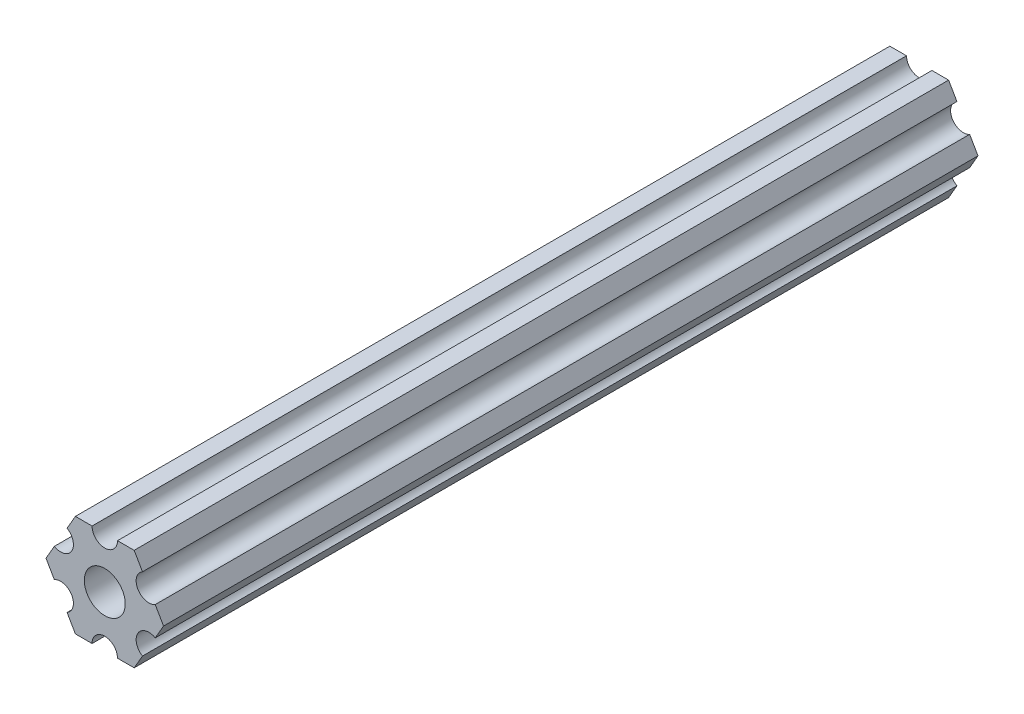
ISO-10303-21;
HEADER;
FILE_DESCRIPTION(('STEP AP214'),'2;1');
FILE_NAME('part.step','',(''),(''),'','','');
FILE_SCHEMA(('AUTOMOTIVE_DESIGN { 1 0 10303 214 1 1 1 1 }'));
ENDSEC;
DATA;
#1=APPLICATION_CONTEXT('core data for automotive mechanical design processes');
#2=APPLICATION_PROTOCOL_DEFINITION('international standard','automotive_design',2000,#1);
#3=PRODUCT_CONTEXT('',#1,'mechanical');
#4=PRODUCT('Part','Part','',(#3));
#5=PRODUCT_RELATED_PRODUCT_CATEGORY('part','',(#4));
#6=PRODUCT_DEFINITION_FORMATION('','',#4);
#7=PRODUCT_DEFINITION_CONTEXT('part definition',#1,'design');
#8=PRODUCT_DEFINITION('design','',#6,#7);
#9=PRODUCT_DEFINITION_SHAPE('','',#8);
#10=(LENGTH_UNIT() NAMED_UNIT(*) SI_UNIT(.MILLI.,.METRE.));
#11=(NAMED_UNIT(*) PLANE_ANGLE_UNIT() SI_UNIT($,.RADIAN.));
#12=(NAMED_UNIT(*) SI_UNIT($,.STERADIAN.) SOLID_ANGLE_UNIT());
#13=UNCERTAINTY_MEASURE_WITH_UNIT(LENGTH_MEASURE(1.E-05),#10,'distance_accuracy_value','');
#14=(GEOMETRIC_REPRESENTATION_CONTEXT(3) GLOBAL_UNCERTAINTY_ASSIGNED_CONTEXT((#13)) GLOBAL_UNIT_ASSIGNED_CONTEXT((#10,
#11,#12)) REPRESENTATION_CONTEXT('',''));
#15=CARTESIAN_POINT('',(0.,0.,0.));
#16=DIRECTION('',(0.,0.,1.));
#17=DIRECTION('',(1.,0.,0.));
#18=AXIS2_PLACEMENT_3D('',#15,#16,#17);
#19=CARTESIAN_POINT('',(3.84699344862377E-07,6.35000022210623,101.6));
#20=DIRECTION('',(0.,0.,-1.));
#21=DIRECTION('',(-1.,0.,0.));
#22=AXIS2_PLACEMENT_3D('',#19,#20,#21);
#23=CYLINDRICAL_SURFACE('',#22,1.58749807650328);
#24=CARTESIAN_POINT('',(3.84699344862377E-07,6.35000022210623,0.));
#25=DIRECTION('',(0.,0.,-1.));
#26=DIRECTION('',(-1.,0.,0.));
#27=AXIS2_PLACEMENT_3D('',#24,#25,#26);
#28=CIRCLE('',#27,1.58749807650328);
#29=CARTESIAN_POINT('',(1.58749807650328,6.35000022210623,0.));
#30=VERTEX_POINT('',#29);
#31=CARTESIAN_POINT('',(-1.58749807650328,6.35000022210623,0.));
#32=VERTEX_POINT('',#31);
#33=EDGE_CURVE('E216',#30,#32,#28,.T.);
#34=ORIENTED_EDGE('',*,*,#33,.T.);
#35=DIRECTION('',(0.,0.,-1.));
#36=VECTOR('',#35,1.);
#37=CARTESIAN_POINT('',(-1.58749807650328,6.35000022210623,101.6));
#38=LINE('',#37,#36);
#39=CARTESIAN_POINT('',(-1.58749807650328,6.35000022210623,101.6));
#40=VERTEX_POINT('',#39);
#41=EDGE_CURVE('E11',#40,#32,#38,.T.);
#42=ORIENTED_EDGE('',*,*,#41,.F.);
#43=CARTESIAN_POINT('',(3.84699344862377E-07,6.35000022210623,101.6));
#44=DIRECTION('',(0.,0.,-1.));
#45=DIRECTION('',(-1.,0.,0.));
#46=AXIS2_PLACEMENT_3D('',#43,#44,#45);
#47=CIRCLE('',#46,1.58749807650328);
#48=CARTESIAN_POINT('',(1.58749807650328,6.35000022210623,101.6));
#49=VERTEX_POINT('',#48);
#50=EDGE_CURVE('E251',#49,#40,#47,.T.);
#51=ORIENTED_EDGE('',*,*,#50,.F.);
#52=DIRECTION('',(0.,0.,-1.));
#53=VECTOR('',#52,1.);
#54=CARTESIAN_POINT('',(1.58749807650328,6.35000022210623,101.6));
#55=LINE('',#54,#53);
#56=EDGE_CURVE('E212',#49,#30,#55,.T.);
#57=ORIENTED_EDGE('',*,*,#56,.T.);
#58=EDGE_LOOP('',(#34,#42,#51,#57));
#59=FACE_BOUND('',#58,.T.);
#60=ADVANCED_FACE('F55',(#59),#23,.F.);
#61=CARTESIAN_POINT('',(-1.58749807650328,6.35000022210623,101.6));
#62=DIRECTION('',(0.,-1.,0.));
#63=DIRECTION('',(1.,0.,0.));
#64=AXIS2_PLACEMENT_3D('',#61,#62,#63);
#65=PLANE('',#64);
#66=DIRECTION('',(-1.,0.,0.));
#67=VECTOR('',#66,1.);
#68=CARTESIAN_POINT('',(-1.58749807650328,6.35000022210623,0.));
#69=LINE('',#68,#67);
#70=CARTESIAN_POINT('',(-3.66617382465472,6.35000022210623,0.));
#71=VERTEX_POINT('',#70);
#72=EDGE_CURVE('E219',#32,#71,#69,.T.);
#73=ORIENTED_EDGE('',*,*,#72,.T.);
#74=DIRECTION('',(0.,0.,-1.));
#75=VECTOR('',#74,1.);
#76=CARTESIAN_POINT('',(-3.66617382465472,6.35000022210623,101.6));
#77=LINE('',#76,#75);
#78=CARTESIAN_POINT('',(-3.66617382465472,6.35000022210623,101.6));
#79=VERTEX_POINT('',#78);
#80=EDGE_CURVE('E64',#79,#71,#77,.T.);
#81=ORIENTED_EDGE('',*,*,#80,.F.);
#82=DIRECTION('',(-1.,0.,0.));
#83=VECTOR('',#82,1.);
#84=CARTESIAN_POINT('',(-1.58749807650328,6.35000022210623,101.6));
#85=LINE('',#84,#83);
#86=EDGE_CURVE('E145',#40,#79,#85,.T.);
#87=ORIENTED_EDGE('',*,*,#86,.F.);
#88=ORIENTED_EDGE('',*,*,#41,.T.);
#89=EDGE_LOOP('',(#73,#81,#87,#88));
#90=FACE_BOUND('',#89,.T.);
#91=ADVANCED_FACE('F371',(#90),#65,.F.);
#92=CARTESIAN_POINT('',(-3.66617382465472,6.35000022210623,101.6));
#93=DIRECTION('',(0.866025373493145,-0.500000052466056,0.));
#94=DIRECTION('',(0.500000052466056,0.866025373493145,0.));
#95=AXIS2_PLACEMENT_3D('',#92,#93,#94);
#96=PLANE('',#95);
#97=DIRECTION('',(-0.500000052466056,-0.866025373493145,0.));
#98=VECTOR('',#97,1.);
#99=CARTESIAN_POINT('',(-3.66617382465472,6.35000022210623,0.));
#100=LINE('',#99,#98);
#101=CARTESIAN_POINT('',(-4.70551103839166,4.54981561357968,0.));
#102=VERTEX_POINT('',#101);
#103=EDGE_CURVE('E222',#71,#102,#100,.T.);
#104=ORIENTED_EDGE('',*,*,#103,.T.);
#105=DIRECTION('',(0.,0.,-1.));
#106=VECTOR('',#105,1.);
#107=CARTESIAN_POINT('',(-4.70551103839166,4.54981561357968,101.6));
#108=LINE('',#107,#106);
#109=CARTESIAN_POINT('',(-4.70551103839166,4.54981561357968,101.6));
#110=VERTEX_POINT('',#109);
#111=EDGE_CURVE('E298',#110,#102,#108,.T.);
#112=ORIENTED_EDGE('',*,*,#111,.F.);
#113=DIRECTION('',(-0.500000052466056,-0.866025373493145,0.));
#114=VECTOR('',#113,1.);
#115=CARTESIAN_POINT('',(-3.66617382465472,6.35000022210623,101.6));
#116=LINE('',#115,#114);
#117=EDGE_CURVE('E306',#79,#110,#116,.T.);
#118=ORIENTED_EDGE('',*,*,#117,.F.);
#119=ORIENTED_EDGE('',*,*,#80,.T.);
#120=EDGE_LOOP('',(#104,#112,#118,#119));
#121=FACE_BOUND('',#120,.T.);
#122=ADVANCED_FACE('F304',(#121),#96,.F.);
#123=CARTESIAN_POINT('',(-5.49926112168152,3.17500033315931,101.6));
#124=DIRECTION('',(0.,0.,-1.));
#125=DIRECTION('',(-1.,0.,0.));
#126=AXIS2_PLACEMENT_3D('',#123,#124,#125);
#127=CYLINDRICAL_SURFACE('',#126,1.5875);
#128=CARTESIAN_POINT('',(-5.49926112168152,3.17500033315931,0.));
#129=DIRECTION('',(0.,0.,-1.));
#130=DIRECTION('',(-1.,0.,0.));
#131=AXIS2_PLACEMENT_3D('',#128,#129,#130);
#132=CIRCLE('',#131,1.5875);
#133=CARTESIAN_POINT('',(-6.29301120497139,1.80018505273894,0.));
#134=VERTEX_POINT('',#133);
#135=EDGE_CURVE('E224',#102,#134,#132,.T.);
#136=ORIENTED_EDGE('',*,*,#135,.T.);
#137=DIRECTION('',(0.,0.,-1.));
#138=VECTOR('',#137,1.);
#139=CARTESIAN_POINT('',(-6.29301120497139,1.80018505273894,101.6));
#140=LINE('',#139,#138);
#141=CARTESIAN_POINT('',(-6.29301120497139,1.80018505273894,101.6));
#142=VERTEX_POINT('',#141);
#143=EDGE_CURVE('E295',#142,#134,#140,.T.);
#144=ORIENTED_EDGE('',*,*,#143,.F.);
#145=CARTESIAN_POINT('',(-5.49926112168152,3.17500033315931,101.6));
#146=DIRECTION('',(0.,0.,-1.));
#147=DIRECTION('',(-1.,0.,0.));
#148=AXIS2_PLACEMENT_3D('',#145,#146,#147);
#149=CIRCLE('',#148,1.5875);
#150=EDGE_CURVE('E324',#110,#142,#149,.T.);
#151=ORIENTED_EDGE('',*,*,#150,.F.);
#152=ORIENTED_EDGE('',*,*,#111,.T.);
#153=EDGE_LOOP('',(#136,#144,#151,#152));
#154=FACE_BOUND('',#153,.T.);
#155=ADVANCED_FACE('F315',(#154),#127,.F.);
#156=CARTESIAN_POINT('',(-6.29301120497139,1.80018505273894,101.6));
#157=DIRECTION('',(0.866025373493145,-0.500000052466056,0.));
#158=DIRECTION('',(0.500000052466056,0.866025373493145,0.));
#159=AXIS2_PLACEMENT_3D('',#156,#157,#158);
#160=PLANE('',#159);
#161=DIRECTION('',(-0.500000052466056,-0.866025373493145,0.));
#162=VECTOR('',#161,1.);
#163=CARTESIAN_POINT('',(-6.29301120497139,1.80018505273894,0.));
#164=LINE('',#163,#162);
#165=CARTESIAN_POINT('',(-7.33234841870826,4.44212515946299E-07,0.));
#166=VERTEX_POINT('',#165);
#167=EDGE_CURVE('E226',#134,#166,#164,.T.);
#168=ORIENTED_EDGE('',*,*,#167,.T.);
#169=DIRECTION('',(0.,0.,-1.));
#170=VECTOR('',#169,1.);
#171=CARTESIAN_POINT('',(-7.33234841870826,4.44212515946299E-07,101.6));
#172=LINE('',#171,#170);
#173=CARTESIAN_POINT('',(-7.33234841870826,4.44212515946299E-07,101.6));
#174=VERTEX_POINT('',#173);
#175=EDGE_CURVE('E292',#174,#166,#172,.T.);
#176=ORIENTED_EDGE('',*,*,#175,.F.);
#177=DIRECTION('',(-0.500000052466056,-0.866025373493145,0.));
#178=VECTOR('',#177,1.);
#179=CARTESIAN_POINT('',(-6.29301120497139,1.80018505273894,101.6));
#180=LINE('',#179,#178);
#181=EDGE_CURVE('E321',#142,#174,#180,.T.);
#182=ORIENTED_EDGE('',*,*,#181,.F.);
#183=ORIENTED_EDGE('',*,*,#143,.T.);
#184=EDGE_LOOP('',(#168,#176,#182,#183));
#185=FACE_BOUND('',#184,.T.);
#186=ADVANCED_FACE('F319',(#185),#160,.F.);
#187=CARTESIAN_POINT('',(-7.33234841870826,4.44212515946299E-07,101.6));
#188=DIRECTION('',(0.866025434075723,0.499999947533953,0.));
#189=DIRECTION('',(-0.499999947533953,0.866025434075723,0.));
#190=AXIS2_PLACEMENT_3D('',#187,#188,#189);
#191=PLANE('',#190);
#192=DIRECTION('',(0.499999947533953,-0.866025434075723,0.));
#193=VECTOR('',#192,1.);
#194=CARTESIAN_POINT('',(-7.33234841870826,4.44212515946299E-07,0.));
#195=LINE('',#194,#193);
#196=CARTESIAN_POINT('',(-6.29301142309098,-1.80018429024546,0.));
#197=VERTEX_POINT('',#196);
#198=EDGE_CURVE('E228',#166,#197,#195,.T.);
#199=ORIENTED_EDGE('',*,*,#198,.T.);
#200=DIRECTION('',(0.,0.,-1.));
#201=VECTOR('',#200,1.);
#202=CARTESIAN_POINT('',(-6.29301142309098,-1.80018429024546,101.6));
#203=LINE('',#202,#201);
#204=CARTESIAN_POINT('',(-6.29301142309098,-1.80018429024546,101.6));
#205=VERTEX_POINT('',#204);
#206=EDGE_CURVE('E288',#205,#197,#203,.T.);
#207=ORIENTED_EDGE('',*,*,#206,.F.);
#208=DIRECTION('',(0.499999947533953,-0.866025434075723,0.));
#209=VECTOR('',#208,1.);
#210=CARTESIAN_POINT('',(-7.33234841870826,4.44212515946299E-07,101.6));
#211=LINE('',#210,#209);
#212=EDGE_CURVE('E323',#174,#205,#211,.T.);
#213=ORIENTED_EDGE('',*,*,#212,.F.);
#214=ORIENTED_EDGE('',*,*,#175,.T.);
#215=EDGE_LOOP('',(#199,#207,#213,#214));
#216=FACE_BOUND('',#215,.T.);
#217=ADVANCED_FACE('F384',(#216),#191,.F.);
#218=CARTESIAN_POINT('',(-5.49926150638083,-3.17499966684068,101.6));
#219=DIRECTION('',(0.,0.,-1.));
#220=DIRECTION('',(-1.,0.,0.));
#221=AXIS2_PLACEMENT_3D('',#218,#219,#220);
#222=CYLINDRICAL_SURFACE('',#221,1.58750000000001);
#223=CARTESIAN_POINT('',(-5.49926150638083,-3.17499966684068,0.));
#224=DIRECTION('',(0.,0.,-1.));
#225=DIRECTION('',(-1.,0.,0.));
#226=AXIS2_PLACEMENT_3D('',#223,#224,#225);
#227=CIRCLE('',#226,1.58750000000001);
#228=CARTESIAN_POINT('',(-4.70551158967068,-4.54981504343589,0.));
#229=VERTEX_POINT('',#228);
#230=EDGE_CURVE('E230',#197,#229,#227,.T.);
#231=ORIENTED_EDGE('',*,*,#230,.T.);
#232=DIRECTION('',(0.,0.,-1.));
#233=VECTOR('',#232,1.);
#234=CARTESIAN_POINT('',(-4.70551158967068,-4.54981504343589,101.6));
#235=LINE('',#234,#233);
#236=CARTESIAN_POINT('',(-4.70551158967068,-4.54981504343589,101.6));
#237=VERTEX_POINT('',#236);
#238=EDGE_CURVE('E284',#237,#229,#235,.T.);
#239=ORIENTED_EDGE('',*,*,#238,.F.);
#240=CARTESIAN_POINT('',(-5.49926150638083,-3.17499966684068,101.6));
#241=DIRECTION('',(0.,0.,-1.));
#242=DIRECTION('',(-1.,0.,0.));
#243=AXIS2_PLACEMENT_3D('',#240,#241,#242);
#244=CIRCLE('',#243,1.58750000000001);
#245=EDGE_CURVE('E326',#205,#237,#244,.T.);
#246=ORIENTED_EDGE('',*,*,#245,.F.);
#247=ORIENTED_EDGE('',*,*,#206,.T.);
#248=EDGE_LOOP('',(#231,#239,#246,#247));
#249=FACE_BOUND('',#248,.T.);
#250=ADVANCED_FACE('F387',(#249),#222,.F.);
#251=CARTESIAN_POINT('',(-4.70551158967068,-4.54981504343589,101.6));
#252=DIRECTION('',(0.866025434075723,0.499999947533953,0.));
#253=DIRECTION('',(-0.499999947533953,0.866025434075723,0.));
#254=AXIS2_PLACEMENT_3D('',#251,#252,#253);
#255=PLANE('',#254);
#256=DIRECTION('',(0.499999947533953,-0.866025434075723,0.));
#257=VECTOR('',#256,1.);
#258=CARTESIAN_POINT('',(-4.70551158967068,-4.54981504343589,0.));
#259=LINE('',#258,#257);
#260=CARTESIAN_POINT('',(-3.66617452134693,-6.34999990382519,0.));
#261=VERTEX_POINT('',#260);
#262=EDGE_CURVE('E232',#229,#261,#259,.T.);
#263=ORIENTED_EDGE('',*,*,#262,.T.);
#264=DIRECTION('',(0.,0.,-1.));
#265=VECTOR('',#264,1.);
#266=CARTESIAN_POINT('',(-3.66617452134693,-6.34999990382519,101.6));
#267=LINE('',#266,#265);
#268=CARTESIAN_POINT('',(-3.66617452134693,-6.34999990382519,101.6));
#269=VERTEX_POINT('',#268);
#270=EDGE_CURVE('E280',#269,#261,#267,.T.);
#271=ORIENTED_EDGE('',*,*,#270,.F.);
#272=DIRECTION('',(0.499999947533953,-0.866025434075723,0.));
#273=VECTOR('',#272,1.);
#274=CARTESIAN_POINT('',(-4.70551158967068,-4.54981504343589,101.6));
#275=LINE('',#274,#273);
#276=EDGE_CURVE('E332',#237,#269,#275,.T.);
#277=ORIENTED_EDGE('',*,*,#276,.F.);
#278=ORIENTED_EDGE('',*,*,#238,.T.);
#279=EDGE_LOOP('',(#263,#271,#277,#278));
#280=FACE_BOUND('',#279,.T.);
#281=ADVANCED_FACE('F390',(#280),#255,.F.);
#282=CARTESIAN_POINT('',(-3.66617452134693,-6.34999990382519,101.6));
#283=DIRECTION('',(0.,1.,0.));
#284=DIRECTION('',(0.,0.,1.));
#285=AXIS2_PLACEMENT_3D('',#282,#283,#284);
#286=PLANE('',#285);
#287=DIRECTION('',(1.,0.,0.));
#288=VECTOR('',#287,1.);
#289=CARTESIAN_POINT('',(-3.66617452134693,-6.34999990382519,0.));
#290=LINE('',#289,#288);
#291=CARTESIAN_POINT('',(-1.58750192349631,-6.34999990382519,0.));
#292=VERTEX_POINT('',#291);
#293=EDGE_CURVE('E234',#261,#292,#290,.T.);
#294=ORIENTED_EDGE('',*,*,#293,.T.);
#295=DIRECTION('',(0.,0.,-1.));
#296=VECTOR('',#295,1.);
#297=CARTESIAN_POINT('',(-1.58750192349631,-6.34999990382519,101.6));
#298=LINE('',#297,#296);
#299=CARTESIAN_POINT('',(-1.58750192349631,-6.34999990382519,101.6));
#300=VERTEX_POINT('',#299);
#301=EDGE_CURVE('E277',#300,#292,#298,.T.);
#302=ORIENTED_EDGE('',*,*,#301,.F.);
#303=DIRECTION('',(1.,0.,0.));
#304=VECTOR('',#303,1.);
#305=CARTESIAN_POINT('',(-3.66617452134693,-6.34999990382519,101.6));
#306=LINE('',#305,#304);
#307=EDGE_CURVE('E334',#269,#300,#306,.T.);
#308=ORIENTED_EDGE('',*,*,#307,.F.);
#309=ORIENTED_EDGE('',*,*,#270,.T.);
#310=EDGE_LOOP('',(#294,#302,#308,#309));
#311=FACE_BOUND('',#310,.T.);
#312=ADVANCED_FACE('F394',(#311),#286,.F.);
#313=CARTESIAN_POINT('',(-3.84699262029331E-07,-6.34999990382519,101.6));
#314=DIRECTION('',(0.,0.,-1.));
#315=DIRECTION('',(-1.,0.,0.));
#316=AXIS2_PLACEMENT_3D('',#313,#314,#315);
#317=CYLINDRICAL_SURFACE('',#316,1.58750192349631);
#318=CARTESIAN_POINT('',(-3.84699262029331E-07,-6.34999990382519,0.));
#319=DIRECTION('',(0.,0.,-1.));
#320=DIRECTION('',(-1.,0.,0.));
#321=AXIS2_PLACEMENT_3D('',#318,#319,#320);
#322=CIRCLE('',#321,1.58750192349631);
#323=CARTESIAN_POINT('',(1.58750153879705,-6.34999990382519,0.));
#324=VERTEX_POINT('',#323);
#325=EDGE_CURVE('E236',#292,#324,#322,.T.);
#326=ORIENTED_EDGE('',*,*,#325,.T.);
#327=DIRECTION('',(0.,0.,-1.));
#328=VECTOR('',#327,1.);
#329=CARTESIAN_POINT('',(1.58750153879705,-6.34999990382519,101.6));
#330=LINE('',#329,#328);
#331=CARTESIAN_POINT('',(1.58750153879705,-6.34999990382519,101.6));
#332=VERTEX_POINT('',#331);
#333=EDGE_CURVE('E273',#332,#324,#330,.T.);
#334=ORIENTED_EDGE('',*,*,#333,.F.);
#335=CARTESIAN_POINT('',(-3.84699262029331E-07,-6.34999990382519,101.6));
#336=DIRECTION('',(0.,0.,-1.));
#337=DIRECTION('',(-1.,0.,0.));
#338=AXIS2_PLACEMENT_3D('',#335,#336,#337);
#339=CIRCLE('',#338,1.58750192349631);
#340=EDGE_CURVE('E336',#300,#332,#339,.T.);
#341=ORIENTED_EDGE('',*,*,#340,.F.);
#342=ORIENTED_EDGE('',*,*,#301,.T.);
#343=EDGE_LOOP('',(#326,#334,#341,#342));
#344=FACE_BOUND('',#343,.T.);
#345=ADVANCED_FACE('F397',(#344),#317,.F.);
#346=CARTESIAN_POINT('',(1.58750192349631,-6.34999990382519,101.6));
#347=DIRECTION('',(0.,1.,0.));
#348=DIRECTION('',(0.,0.,1.));
#349=AXIS2_PLACEMENT_3D('',#346,#347,#348);
#350=PLANE('',#349);
#351=DIRECTION('',(1.,0.,0.));
#352=VECTOR('',#351,1.);
#353=CARTESIAN_POINT('',(1.58750192349631,-6.34999990382519,0.));
#354=LINE('',#353,#352);
#355=CARTESIAN_POINT('',(3.66617382465481,-6.34999990382519,0.));
#356=VERTEX_POINT('',#355);
#357=EDGE_CURVE('E238',#324,#356,#354,.T.);
#358=ORIENTED_EDGE('',*,*,#357,.T.);
#359=DIRECTION('',(0.,0.,-1.));
#360=VECTOR('',#359,1.);
#361=CARTESIAN_POINT('',(3.66617382465481,-6.34999990382519,101.6));
#362=LINE('',#361,#360);
#363=CARTESIAN_POINT('',(3.66617382465481,-6.34999990382519,101.6));
#364=VERTEX_POINT('',#363);
#365=EDGE_CURVE('E269',#364,#356,#362,.T.);
#366=ORIENTED_EDGE('',*,*,#365,.F.);
#367=DIRECTION('',(1.,0.,0.));
#368=VECTOR('',#367,1.);
#369=CARTESIAN_POINT('',(1.58750192349631,-6.34999990382519,101.6));
#370=LINE('',#369,#368);
#371=EDGE_CURVE('E338',#332,#364,#370,.T.);
#372=ORIENTED_EDGE('',*,*,#371,.F.);
#373=ORIENTED_EDGE('',*,*,#333,.T.);
#374=EDGE_LOOP('',(#358,#366,#372,#373));
#375=FACE_BOUND('',#374,.T.);
#376=ADVANCED_FACE('F401',(#375),#350,.F.);
#377=CARTESIAN_POINT('',(3.66617382465481,-6.34999990382519,101.6));
#378=DIRECTION('',(-0.866025403784439,0.5,0.));
#379=DIRECTION('',(-0.5,-0.866025403784439,0.));
#380=AXIS2_PLACEMENT_3D('',#377,#378,#379);
#381=PLANE('',#380);
#382=DIRECTION('',(0.5,0.866025403784439,0.));
#383=VECTOR('',#382,1.);
#384=CARTESIAN_POINT('',(3.66617382465481,-6.34999990382519,0.));
#385=LINE('',#384,#383);
#386=CARTESIAN_POINT('',(4.70551092933191,-4.54981523233291,0.));
#387=VERTEX_POINT('',#386);
#388=EDGE_CURVE('E240',#356,#387,#385,.T.);
#389=ORIENTED_EDGE('',*,*,#388,.T.);
#390=DIRECTION('',(0.,0.,-1.));
#391=VECTOR('',#390,1.);
#392=CARTESIAN_POINT('',(4.70551092933191,-4.54981523233291,101.6));
#393=LINE('',#392,#391);
#394=CARTESIAN_POINT('',(4.70551092933191,-4.54981523233291,101.6));
#395=VERTEX_POINT('',#394);
#396=EDGE_CURVE('E265',#395,#387,#393,.T.);
#397=ORIENTED_EDGE('',*,*,#396,.F.);
#398=DIRECTION('',(0.5,0.866025403784439,0.));
#399=VECTOR('',#398,1.);
#400=CARTESIAN_POINT('',(3.66617382465481,-6.34999990382519,101.6));
#401=LINE('',#400,#399);
#402=EDGE_CURVE('E340',#364,#395,#401,.T.);
#403=ORIENTED_EDGE('',*,*,#402,.F.);
#404=ORIENTED_EDGE('',*,*,#365,.T.);
#405=EDGE_LOOP('',(#389,#397,#403,#404));
#406=FACE_BOUND('',#405,.T.);
#407=ADVANCED_FACE('F405',(#406),#381,.F.);
#408=CARTESIAN_POINT('',(5.49926092933191,-3.17499990382512,101.6));
#409=DIRECTION('',(0.,0.,-1.));
#410=DIRECTION('',(-1.,0.,0.));
#411=AXIS2_PLACEMENT_3D('',#408,#409,#410);
#412=CYLINDRICAL_SURFACE('',#411,1.5875);
#413=CARTESIAN_POINT('',(5.49926092933191,-3.17499990382512,0.));
#414=DIRECTION('',(0.,0.,-1.));
#415=DIRECTION('',(-1.,0.,0.));
#416=AXIS2_PLACEMENT_3D('',#413,#414,#415);
#417=CIRCLE('',#416,1.5875);
#418=CARTESIAN_POINT('',(6.29301092933191,-1.80018457531732,0.));
#419=VERTEX_POINT('',#418);
#420=EDGE_CURVE('E242',#387,#419,#417,.T.);
#421=ORIENTED_EDGE('',*,*,#420,.T.);
#422=DIRECTION('',(0.,0.,-1.));
#423=VECTOR('',#422,1.);
#424=CARTESIAN_POINT('',(6.29301092933191,-1.80018457531732,101.6));
#425=LINE('',#424,#423);
#426=CARTESIAN_POINT('',(6.29301092933191,-1.80018457531732,101.6));
#427=VERTEX_POINT('',#426);
#428=EDGE_CURVE('E261',#427,#419,#425,.T.);
#429=ORIENTED_EDGE('',*,*,#428,.F.);
#430=CARTESIAN_POINT('',(5.49926092933191,-3.17499990382512,101.6));
#431=DIRECTION('',(0.,0.,-1.));
#432=DIRECTION('',(-1.,0.,0.));
#433=AXIS2_PLACEMENT_3D('',#430,#431,#432);
#434=CIRCLE('',#433,1.5875);
#435=EDGE_CURVE('E342',#395,#427,#434,.T.);
#436=ORIENTED_EDGE('',*,*,#435,.F.);
#437=ORIENTED_EDGE('',*,*,#396,.T.);
#438=EDGE_LOOP('',(#421,#429,#436,#437));
#439=FACE_BOUND('',#438,.T.);
#440=ADVANCED_FACE('F408',(#439),#412,.F.);
#441=CARTESIAN_POINT('',(6.29301092933191,-1.80018457531732,101.6));
#442=DIRECTION('',(-0.866025403784439,0.5,0.));
#443=DIRECTION('',(-0.5,-0.866025403784439,0.));
#444=AXIS2_PLACEMENT_3D('',#441,#442,#443);
#445=PLANE('',#444);
#446=DIRECTION('',(0.5,0.866025403784439,0.));
#447=VECTOR('',#446,1.);
#448=CARTESIAN_POINT('',(6.29301092933191,-1.80018457531732,0.));
#449=LINE('',#448,#447);
#450=CARTESIAN_POINT('',(7.33234803400894,9.6174836107174E-08,0.));
#451=VERTEX_POINT('',#450);
#452=EDGE_CURVE('E244',#419,#451,#449,.T.);
#453=ORIENTED_EDGE('',*,*,#452,.T.);
#454=DIRECTION('',(0.,0.,-1.));
#455=VECTOR('',#454,1.);
#456=CARTESIAN_POINT('',(7.33234803400894,9.6174836107174E-08,101.6));
#457=LINE('',#456,#455);
#458=CARTESIAN_POINT('',(7.33234803400894,9.6174836107174E-08,101.6));
#459=VERTEX_POINT('',#458);
#460=EDGE_CURVE('E257',#459,#451,#457,.T.);
#461=ORIENTED_EDGE('',*,*,#460,.F.);
#462=DIRECTION('',(0.5,0.866025403784439,0.));
#463=VECTOR('',#462,1.);
#464=CARTESIAN_POINT('',(6.29301092933191,-1.80018457531732,101.6));
#465=LINE('',#464,#463);
#466=EDGE_CURVE('E344',#427,#459,#465,.T.);
#467=ORIENTED_EDGE('',*,*,#466,.F.);
#468=ORIENTED_EDGE('',*,*,#428,.T.);
#469=EDGE_LOOP('',(#453,#461,#467,#468));
#470=FACE_BOUND('',#469,.T.);
#471=ADVANCED_FACE('F350',(#470),#445,.F.);
#472=CARTESIAN_POINT('',(7.33234803400894,9.6174836107174E-08,101.6));
#473=DIRECTION('',(-0.866025449221368,-0.499999921300921,0.));
#474=DIRECTION('',(0.499999921300921,-0.866025449221368,0.));
#475=AXIS2_PLACEMENT_3D('',#472,#473,#474);
#476=PLANE('',#475);
#477=DIRECTION('',(-0.499999921300921,0.866025449221368,0.));
#478=VECTOR('',#477,1.);
#479=CARTESIAN_POINT('',(7.33234803400894,9.6174836107174E-08,0.));
#480=LINE('',#479,#478);
#481=CARTESIAN_POINT('',(6.29301117773375,1.80018471521667,0.));
#482=VERTEX_POINT('',#481);
#483=EDGE_CURVE('E246',#451,#482,#480,.T.);
#484=ORIENTED_EDGE('',*,*,#483,.T.);
#485=DIRECTION('',(0.,0.,-1.));
#486=VECTOR('',#485,1.);
#487=CARTESIAN_POINT('',(6.29301117773375,1.80018471521667,101.6));
#488=LINE('',#487,#486);
#489=CARTESIAN_POINT('',(6.29301117773375,1.80018471521667,101.6));
#490=VERTEX_POINT('',#489);
#491=EDGE_CURVE('E204',#490,#482,#488,.T.);
#492=ORIENTED_EDGE('',*,*,#491,.F.);
#493=DIRECTION('',(-0.499999921300921,0.866025449221368,0.));
#494=VECTOR('',#493,1.);
#495=CARTESIAN_POINT('',(7.33234803400894,9.6174836107174E-08,101.6));
#496=LINE('',#495,#494);
#497=EDGE_CURVE('E194',#459,#490,#496,.T.);
#498=ORIENTED_EDGE('',*,*,#497,.F.);
#499=ORIENTED_EDGE('',*,*,#460,.T.);
#500=EDGE_LOOP('',(#484,#492,#498,#499));
#501=FACE_BOUND('',#500,.T.);
#502=ADVANCED_FACE('F354',(#501),#476,.F.);
#503=CARTESIAN_POINT('',(5.49926130266854,3.1750001158556,101.6));
#504=DIRECTION('',(0.,0.,-1.));
#505=DIRECTION('',(-1.,0.,0.));
#506=AXIS2_PLACEMENT_3D('',#503,#504,#505);
#507=CYLINDRICAL_SURFACE('',#506,1.5875);
#508=CARTESIAN_POINT('',(5.49926130266854,3.1750001158556,0.));
#509=DIRECTION('',(0.,0.,-1.));
#510=DIRECTION('',(-1.,0.,0.));
#511=AXIS2_PLACEMENT_3D('',#508,#509,#510);
#512=CIRCLE('',#511,1.5875);
#513=CARTESIAN_POINT('',(4.70551142760333,4.54981551649452,0.));
#514=VERTEX_POINT('',#513);
#515=EDGE_CURVE('E202',#482,#514,#512,.T.);
#516=ORIENTED_EDGE('',*,*,#515,.T.);
#517=DIRECTION('',(0.,0.,-1.));
#518=VECTOR('',#517,1.);
#519=CARTESIAN_POINT('',(4.70551142760333,4.54981551649452,101.6));
#520=LINE('',#519,#518);
#521=CARTESIAN_POINT('',(4.70551142760333,4.54981551649452,101.6));
#522=VERTEX_POINT('',#521);
#523=EDGE_CURVE('E199',#522,#514,#520,.T.);
#524=ORIENTED_EDGE('',*,*,#523,.F.);
#525=CARTESIAN_POINT('',(5.49926130266854,3.1750001158556,101.6));
#526=DIRECTION('',(0.,0.,-1.));
#527=DIRECTION('',(-1.,0.,0.));
#528=AXIS2_PLACEMENT_3D('',#525,#526,#527);
#529=CIRCLE('',#528,1.5875);
#530=EDGE_CURVE('E188',#490,#522,#529,.T.);
#531=ORIENTED_EDGE('',*,*,#530,.F.);
#532=ORIENTED_EDGE('',*,*,#491,.T.);
#533=EDGE_LOOP('',(#516,#524,#531,#532));
#534=FACE_BOUND('',#533,.T.);
#535=ADVANCED_FACE('F200',(#534),#507,.F.);
#536=CARTESIAN_POINT('',(4.70551142760333,4.54981551649452,101.6));
#537=DIRECTION('',(-0.866025449221368,-0.499999921300922,0.));
#538=DIRECTION('',(0.499999921300922,-0.866025449221368,0.));
#539=AXIS2_PLACEMENT_3D('',#536,#537,#538);
#540=PLANE('',#539);
#541=DIRECTION('',(-0.499999921300921,0.866025449221368,0.));
#542=VECTOR('',#541,1.);
#543=CARTESIAN_POINT('',(4.70551142760333,4.54981551649452,0.));
#544=LINE('',#543,#542);
#545=CARTESIAN_POINT('',(3.66617452134701,6.35000022210623,0.));
#546=VERTEX_POINT('',#545);
#547=EDGE_CURVE('E131',#514,#546,#544,.T.);
#548=ORIENTED_EDGE('',*,*,#547,.T.);
#549=DIRECTION('',(0.,0.,-1.));
#550=VECTOR('',#549,1.);
#551=CARTESIAN_POINT('',(3.66617452134701,6.35000022210623,101.6));
#552=LINE('',#551,#550);
#553=CARTESIAN_POINT('',(3.66617452134701,6.35000022210623,101.6));
#554=VERTEX_POINT('',#553);
#555=EDGE_CURVE('E205',#554,#546,#552,.T.);
#556=ORIENTED_EDGE('',*,*,#555,.F.);
#557=DIRECTION('',(-0.499999921300921,0.866025449221368,0.));
#558=VECTOR('',#557,1.);
#559=CARTESIAN_POINT('',(4.70551142760333,4.54981551649452,101.6));
#560=LINE('',#559,#558);
#561=EDGE_CURVE('E192',#522,#554,#560,.T.);
#562=ORIENTED_EDGE('',*,*,#561,.F.);
#563=ORIENTED_EDGE('',*,*,#523,.T.);
#564=EDGE_LOOP('',(#548,#556,#562,#563));
#565=FACE_BOUND('',#564,.T.);
#566=ADVANCED_FACE('F207',(#565),#540,.F.);
#567=CARTESIAN_POINT('',(3.66617452134701,6.35000022210623,101.6));
#568=DIRECTION('',(0.,-1.,0.));
#569=DIRECTION('',(1.,0.,0.));
#570=AXIS2_PLACEMENT_3D('',#567,#568,#569);
#571=PLANE('',#570);
#572=DIRECTION('',(-1.,0.,0.));
#573=VECTOR('',#572,1.);
#574=CARTESIAN_POINT('',(3.66617452134701,6.35000022210623,0.));
#575=LINE('',#574,#573);
#576=EDGE_CURVE('E137',#546,#30,#575,.T.);
#577=ORIENTED_EDGE('',*,*,#576,.T.);
#578=ORIENTED_EDGE('',*,*,#56,.F.);
#579=DIRECTION('',(-1.,0.,0.));
#580=VECTOR('',#579,1.);
#581=CARTESIAN_POINT('',(3.66617452134701,6.35000022210623,101.6));
#582=LINE('',#581,#580);
#583=EDGE_CURVE('E72',#554,#49,#582,.T.);
#584=ORIENTED_EDGE('',*,*,#583,.F.);
#585=ORIENTED_EDGE('',*,*,#555,.T.);
#586=EDGE_LOOP('',(#577,#578,#584,#585));
#587=FACE_BOUND('',#586,.T.);
#588=ADVANCED_FACE('F358',(#587),#571,.F.);
#589=CARTESIAN_POINT('',(3.84699344862377E-07,6.35000022210623,101.6));
#590=DIRECTION('',(0.,0.,-1.));
#591=DIRECTION('',(-1.,0.,0.));
#592=AXIS2_PLACEMENT_3D('',#589,#590,#591);
#593=PLANE('',#592);
#594=CARTESIAN_POINT('',(0.,0.,101.6));
#595=DIRECTION('',(0.,0.,1.));
#596=DIRECTION('',(1.,0.,0.));
#597=AXIS2_PLACEMENT_3D('',#594,#595,#596);
#598=CIRCLE('',#597,2.5527);
#599=CARTESIAN_POINT('',(2.5527,0.,101.6));
#600=VERTEX_POINT('',#599);
#601=EDGE_CURVE('E567',#600,#600,#598,.T.);
#602=ORIENTED_EDGE('',*,*,#601,.F.);
#603=EDGE_LOOP('',(#602));
#604=FACE_BOUND('',#603,.T.);
#605=ORIENTED_EDGE('',*,*,#50,.T.);
#606=ORIENTED_EDGE('',*,*,#86,.T.);
#607=ORIENTED_EDGE('',*,*,#117,.T.);
#608=ORIENTED_EDGE('',*,*,#150,.T.);
#609=ORIENTED_EDGE('',*,*,#181,.T.);
#610=ORIENTED_EDGE('',*,*,#212,.T.);
#611=ORIENTED_EDGE('',*,*,#245,.T.);
#612=ORIENTED_EDGE('',*,*,#276,.T.);
#613=ORIENTED_EDGE('',*,*,#307,.T.);
#614=ORIENTED_EDGE('',*,*,#340,.T.);
#615=ORIENTED_EDGE('',*,*,#371,.T.);
#616=ORIENTED_EDGE('',*,*,#402,.T.);
#617=ORIENTED_EDGE('',*,*,#435,.T.);
#618=ORIENTED_EDGE('',*,*,#466,.T.);
#619=ORIENTED_EDGE('',*,*,#497,.T.);
#620=ORIENTED_EDGE('',*,*,#530,.T.);
#621=ORIENTED_EDGE('',*,*,#561,.T.);
#622=ORIENTED_EDGE('',*,*,#583,.T.);
#623=EDGE_LOOP('',(#605,#606,#607,#608,#609,#610,#611,#612,#613,#614,#615,#616,#617,#618,#619,
#620,#621,#622));
#624=FACE_BOUND('',#623,.T.);
#625=ADVANCED_FACE('F190',(#604,#624),#593,.F.);
#626=CARTESIAN_POINT('',(3.84699344862377E-07,6.35000022210623,0.));
#627=DIRECTION('',(0.,0.,-1.));
#628=DIRECTION('',(-1.,0.,0.));
#629=AXIS2_PLACEMENT_3D('',#626,#627,#628);
#630=PLANE('',#629);
#631=CARTESIAN_POINT('',(0.,0.,0.));
#632=DIRECTION('',(0.,0.,1.));
#633=DIRECTION('',(1.,0.,0.));
#634=AXIS2_PLACEMENT_3D('',#631,#632,#633);
#635=CIRCLE('',#634,2.55269999999999);
#636=CARTESIAN_POINT('',(2.55269999999999,0.,0.));
#637=VERTEX_POINT('',#636);
#638=EDGE_CURVE('E220',#637,#637,#635,.T.);
#639=ORIENTED_EDGE('',*,*,#638,.T.);
#640=EDGE_LOOP('',(#639));
#641=FACE_BOUND('',#640,.T.);
#642=ORIENTED_EDGE('',*,*,#33,.F.);
#643=ORIENTED_EDGE('',*,*,#576,.F.);
#644=ORIENTED_EDGE('',*,*,#547,.F.);
#645=ORIENTED_EDGE('',*,*,#515,.F.);
#646=ORIENTED_EDGE('',*,*,#483,.F.);
#647=ORIENTED_EDGE('',*,*,#452,.F.);
#648=ORIENTED_EDGE('',*,*,#420,.F.);
#649=ORIENTED_EDGE('',*,*,#388,.F.);
#650=ORIENTED_EDGE('',*,*,#357,.F.);
#651=ORIENTED_EDGE('',*,*,#325,.F.);
#652=ORIENTED_EDGE('',*,*,#293,.F.);
#653=ORIENTED_EDGE('',*,*,#262,.F.);
#654=ORIENTED_EDGE('',*,*,#230,.F.);
#655=ORIENTED_EDGE('',*,*,#198,.F.);
#656=ORIENTED_EDGE('',*,*,#167,.F.);
#657=ORIENTED_EDGE('',*,*,#135,.F.);
#658=ORIENTED_EDGE('',*,*,#103,.F.);
#659=ORIENTED_EDGE('',*,*,#72,.F.);
#660=EDGE_LOOP('',(#642,#643,#644,#645,#646,#647,#648,#649,#650,#651,#652,#653,#654,#655,#656,
#657,#658,#659));
#661=FACE_BOUND('',#660,.T.);
#662=ADVANCED_FACE('F310',(#641,#661),#630,.T.);
#663=CARTESIAN_POINT('',(0.,0.,101.6));
#664=DIRECTION('',(0.,0.,1.));
#665=DIRECTION('',(1.,0.,0.));
#666=AXIS2_PLACEMENT_3D('',#663,#664,#665);
#667=CYLINDRICAL_SURFACE('',#666,2.55269999999999);
#668=ORIENTED_EDGE('',*,*,#638,.F.);
#669=EDGE_LOOP('',(#668));
#670=FACE_BOUND('',#669,.T.);
#671=ORIENTED_EDGE('',*,*,#601,.T.);
#672=EDGE_LOOP('',(#671));
#673=FACE_BOUND('',#672,.T.);
#674=ADVANCED_FACE('F427',(#670,#673),#667,.F.);
#675=CLOSED_SHELL('',(#60,#91,#122,#155,#186,#217,#250,#281,#312,#345,#376,#407,#440,#471,#502,
#535,#566,#588,#625,#662,#674));
#676=MANIFOLD_SOLID_BREP('B2',#675);
#677=ADVANCED_BREP_SHAPE_REPRESENTATION('',(#18,#676),#14);
#678=SHAPE_DEFINITION_REPRESENTATION(#9,#677);
ENDSEC;
END-ISO-10303-21;
